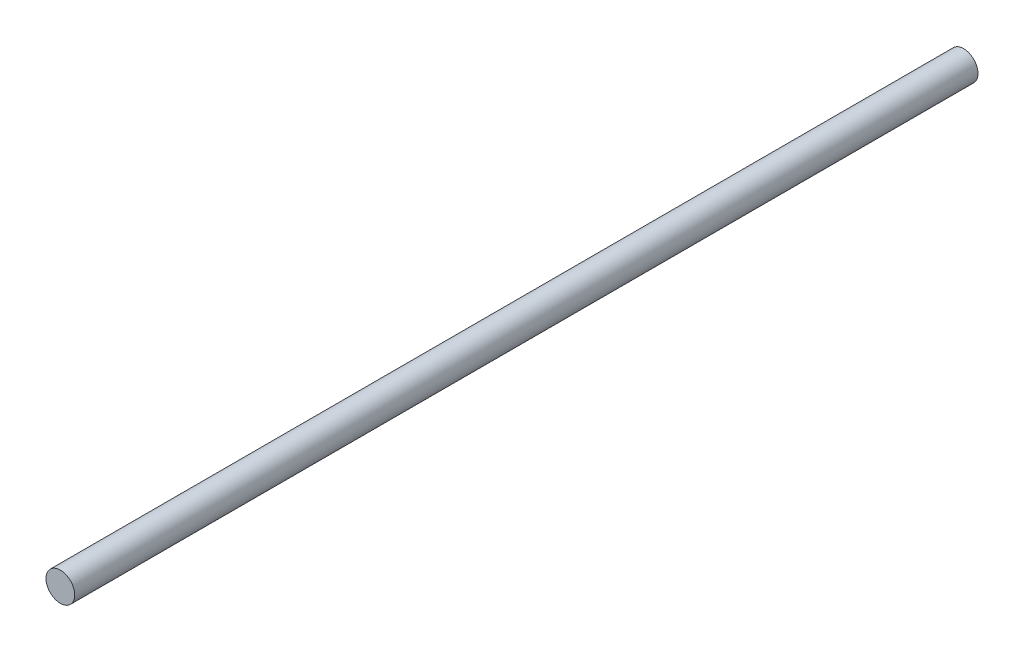
ISO-10303-21;
HEADER;
FILE_DESCRIPTION(('STEP AP214'),'2;1');
FILE_NAME('part.step','',(''),(''),'','','');
FILE_SCHEMA(('AUTOMOTIVE_DESIGN { 1 0 10303 214 1 1 1 1 }'));
ENDSEC;
DATA;
#1=APPLICATION_CONTEXT('core data for automotive mechanical design processes');
#2=APPLICATION_PROTOCOL_DEFINITION('international standard','automotive_design',2000,#1);
#3=PRODUCT_CONTEXT('',#1,'mechanical');
#4=PRODUCT('Part','Part','',(#3));
#5=PRODUCT_RELATED_PRODUCT_CATEGORY('part','',(#4));
#6=PRODUCT_DEFINITION_FORMATION('','',#4);
#7=PRODUCT_DEFINITION_CONTEXT('part definition',#1,'design');
#8=PRODUCT_DEFINITION('design','',#6,#7);
#9=PRODUCT_DEFINITION_SHAPE('','',#8);
#10=(LENGTH_UNIT() NAMED_UNIT(*) SI_UNIT(.MILLI.,.METRE.));
#11=(NAMED_UNIT(*) PLANE_ANGLE_UNIT() SI_UNIT($,.RADIAN.));
#12=(NAMED_UNIT(*) SI_UNIT($,.STERADIAN.) SOLID_ANGLE_UNIT());
#13=UNCERTAINTY_MEASURE_WITH_UNIT(LENGTH_MEASURE(1.E-05),#10,'distance_accuracy_value','');
#14=(GEOMETRIC_REPRESENTATION_CONTEXT(3) GLOBAL_UNCERTAINTY_ASSIGNED_CONTEXT((#13)) GLOBAL_UNIT_ASSIGNED_CONTEXT((#10,
#11,#12)) REPRESENTATION_CONTEXT('',''));
#15=CARTESIAN_POINT('',(0.,0.,0.));
#16=DIRECTION('',(0.,0.,1.));
#17=DIRECTION('',(1.,0.,0.));
#18=AXIS2_PLACEMENT_3D('',#15,#16,#17);
#19=CARTESIAN_POINT('',(0.,0.,251.));
#20=DIRECTION('',(0.,0.,-1.));
#21=DIRECTION('',(-1.,0.,0.));
#22=AXIS2_PLACEMENT_3D('',#19,#20,#21);
#23=CYLINDRICAL_SURFACE('',#22,8.);
#24=CARTESIAN_POINT('',(0.,0.,251.));
#25=DIRECTION('',(0.,0.,1.));
#26=DIRECTION('',(1.,0.,0.));
#27=AXIS2_PLACEMENT_3D('',#24,#25,#26);
#28=CIRCLE('',#27,8.);
#29=CARTESIAN_POINT('',(8.,0.,251.));
#30=VERTEX_POINT('',#29);
#31=EDGE_CURVE('E10',#30,#30,#28,.T.);
#32=ORIENTED_EDGE('',*,*,#31,.F.);
#33=EDGE_LOOP('',(#32));
#34=FACE_BOUND('',#33,.T.);
#35=CARTESIAN_POINT('',(0.,0.,-251.));
#36=DIRECTION('',(0.,0.,1.));
#37=DIRECTION('',(1.,0.,0.));
#38=AXIS2_PLACEMENT_3D('',#35,#36,#37);
#39=CIRCLE('',#38,8.);
#40=CARTESIAN_POINT('',(8.,0.,-251.));
#41=VERTEX_POINT('',#40);
#42=EDGE_CURVE('E33',#41,#41,#39,.T.);
#43=ORIENTED_EDGE('',*,*,#42,.T.);
#44=EDGE_LOOP('',(#43));
#45=FACE_BOUND('',#44,.T.);
#46=ADVANCED_FACE('F30',(#34,#45),#23,.T.);
#47=CARTESIAN_POINT('',(0.,0.,251.));
#48=DIRECTION('',(0.,0.,1.));
#49=DIRECTION('',(1.,0.,0.));
#50=AXIS2_PLACEMENT_3D('',#47,#48,#49);
#51=PLANE('',#50);
#52=ORIENTED_EDGE('',*,*,#31,.T.);
#53=EDGE_LOOP('',(#52));
#54=FACE_BOUND('',#53,.T.);
#55=ADVANCED_FACE('F45',(#54),#51,.T.);
#56=CARTESIAN_POINT('',(0.,0.,-251.));
#57=DIRECTION('',(0.,0.,1.));
#58=DIRECTION('',(1.,0.,0.));
#59=AXIS2_PLACEMENT_3D('',#56,#57,#58);
#60=PLANE('',#59);
#61=ORIENTED_EDGE('',*,*,#42,.F.);
#62=EDGE_LOOP('',(#61));
#63=FACE_BOUND('',#62,.T.);
#64=ADVANCED_FACE('F43',(#63),#60,.F.);
#65=CLOSED_SHELL('',(#46,#55,#64));
#66=MANIFOLD_SOLID_BREP('B2',#65);
#67=ADVANCED_BREP_SHAPE_REPRESENTATION('',(#18,#66),#14);
#68=SHAPE_DEFINITION_REPRESENTATION(#9,#67);
ENDSEC;
END-ISO-10303-21;
